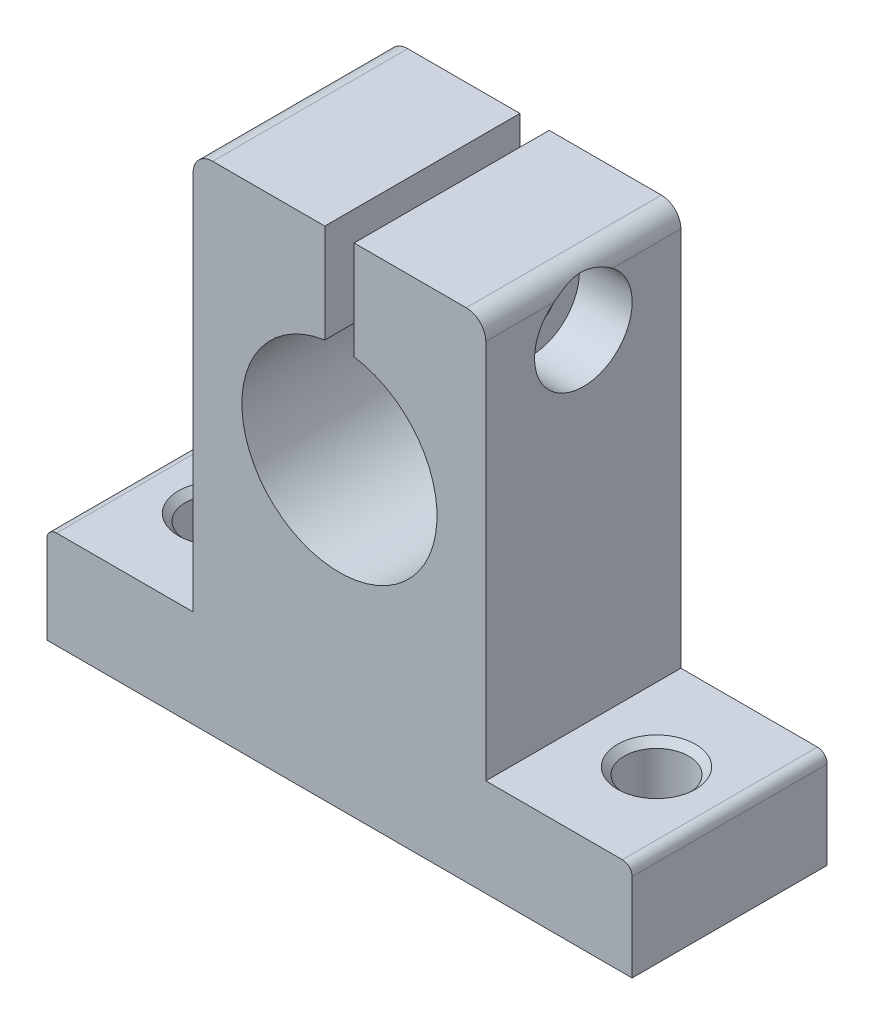
ISO-10303-21;
HEADER;
FILE_DESCRIPTION(('STEP AP214'),'2;1');
FILE_NAME('part.step','',(''),(''),'','','');
FILE_SCHEMA(('AUTOMOTIVE_DESIGN { 1 0 10303 214 1 1 1 1 }'));
ENDSEC;
DATA;
#1=APPLICATION_CONTEXT('core data for automotive mechanical design processes');
#2=APPLICATION_PROTOCOL_DEFINITION('international standard','automotive_design',2000,#1);
#3=PRODUCT_CONTEXT('',#1,'mechanical');
#4=PRODUCT('Part','Part','',(#3));
#5=PRODUCT_RELATED_PRODUCT_CATEGORY('part','',(#4));
#6=PRODUCT_DEFINITION_FORMATION('','',#4);
#7=PRODUCT_DEFINITION_CONTEXT('part definition',#1,'design');
#8=PRODUCT_DEFINITION('design','',#6,#7);
#9=PRODUCT_DEFINITION_SHAPE('','',#8);
#10=(LENGTH_UNIT() NAMED_UNIT(*) SI_UNIT(.MILLI.,.METRE.));
#11=(NAMED_UNIT(*) PLANE_ANGLE_UNIT() SI_UNIT($,.RADIAN.));
#12=(NAMED_UNIT(*) SI_UNIT($,.STERADIAN.) SOLID_ANGLE_UNIT());
#13=UNCERTAINTY_MEASURE_WITH_UNIT(LENGTH_MEASURE(1.E-05),#10,'distance_accuracy_value','');
#14=(GEOMETRIC_REPRESENTATION_CONTEXT(3) GLOBAL_UNCERTAINTY_ASSIGNED_CONTEXT((#13)) GLOBAL_UNIT_ASSIGNED_CONTEXT((#10,
#11,#12)) REPRESENTATION_CONTEXT('',''));
#15=CARTESIAN_POINT('',(0.,0.,0.));
#16=DIRECTION('',(0.,0.,1.));
#17=DIRECTION('',(1.,0.,0.));
#18=AXIS2_PLACEMENT_3D('',#15,#16,#17);
#19=CARTESIAN_POINT('',(-30.,0.,20.));
#20=DIRECTION('',(1.,0.,0.));
#21=DIRECTION('',(0.,0.,-1.));
#22=AXIS2_PLACEMENT_3D('',#19,#20,#21);
#23=PLANE('',#22);
#24=DIRECTION('',(0.,-1.,0.));
#25=VECTOR('',#24,1.);
#26=CARTESIAN_POINT('',(-30.,0.,0.));
#27=LINE('',#26,#25);
#28=CARTESIAN_POINT('',(-30.,8.99999999999999,0.));
#29=VERTEX_POINT('',#28);
#30=CARTESIAN_POINT('',(-30.,0.,0.));
#31=VERTEX_POINT('',#30);
#32=EDGE_CURVE('E198',#29,#31,#27,.T.);
#33=ORIENTED_EDGE('',*,*,#32,.T.);
#34=DIRECTION('',(0.,0.,-1.));
#35=VECTOR('',#34,1.);
#36=CARTESIAN_POINT('',(-30.,0.,20.));
#37=LINE('',#36,#35);
#38=CARTESIAN_POINT('',(-30.,0.,20.));
#39=VERTEX_POINT('',#38);
#40=EDGE_CURVE('E48',#39,#31,#37,.T.);
#41=ORIENTED_EDGE('',*,*,#40,.F.);
#42=DIRECTION('',(0.,-1.,0.));
#43=VECTOR('',#42,1.);
#44=CARTESIAN_POINT('',(-30.,0.,20.));
#45=LINE('',#44,#43);
#46=CARTESIAN_POINT('',(-30.,8.99999999999999,20.));
#47=VERTEX_POINT('',#46);
#48=EDGE_CURVE('E247',#47,#39,#45,.T.);
#49=ORIENTED_EDGE('',*,*,#48,.F.);
#50=DIRECTION('',(0.,0.,-1.));
#51=VECTOR('',#50,1.);
#52=CARTESIAN_POINT('',(-30.,8.99999999999999,20.));
#53=LINE('',#52,#51);
#54=EDGE_CURVE('E194',#47,#29,#53,.T.);
#55=ORIENTED_EDGE('',*,*,#54,.T.);
#56=EDGE_LOOP('',(#33,#41,#49,#55));
#57=FACE_BOUND('',#56,.T.);
#58=ADVANCED_FACE('F39',(#57),#23,.F.);
#59=CARTESIAN_POINT('',(30.,0.,20.));
#60=DIRECTION('',(0.,1.,0.));
#61=DIRECTION('',(0.,0.,1.));
#62=AXIS2_PLACEMENT_3D('',#59,#60,#61);
#63=PLANE('',#62);
#64=CARTESIAN_POINT('',(-22.5,0.,10.));
#65=DIRECTION('',(0.,1.,0.));
#66=DIRECTION('',(0.,0.,1.));
#67=AXIS2_PLACEMENT_3D('',#64,#65,#66);
#68=CIRCLE('',#67,3.3);
#69=CARTESIAN_POINT('',(-22.5,0.,13.3));
#70=VERTEX_POINT('',#69);
#71=EDGE_CURVE('E452',#70,#70,#68,.T.);
#72=ORIENTED_EDGE('',*,*,#71,.T.);
#73=EDGE_LOOP('',(#72));
#74=FACE_BOUND('',#73,.T.);
#75=CARTESIAN_POINT('',(22.5,0.,10.));
#76=DIRECTION('',(0.,1.,0.));
#77=DIRECTION('',(0.,0.,1.));
#78=AXIS2_PLACEMENT_3D('',#75,#76,#77);
#79=CIRCLE('',#78,3.3);
#80=CARTESIAN_POINT('',(22.5,0.,13.3));
#81=VERTEX_POINT('',#80);
#82=EDGE_CURVE('E203',#81,#81,#79,.T.);
#83=ORIENTED_EDGE('',*,*,#82,.T.);
#84=EDGE_LOOP('',(#83));
#85=FACE_BOUND('',#84,.T.);
#86=DIRECTION('',(1.,0.,0.));
#87=VECTOR('',#86,1.);
#88=CARTESIAN_POINT('',(30.,0.,0.));
#89=LINE('',#88,#87);
#90=CARTESIAN_POINT('',(30.,0.,0.));
#91=VERTEX_POINT('',#90);
#92=EDGE_CURVE('E202',#31,#91,#89,.T.);
#93=ORIENTED_EDGE('',*,*,#92,.T.);
#94=DIRECTION('',(0.,0.,-1.));
#95=VECTOR('',#94,1.);
#96=CARTESIAN_POINT('',(30.,0.,20.));
#97=LINE('',#96,#95);
#98=CARTESIAN_POINT('',(30.,0.,20.));
#99=VERTEX_POINT('',#98);
#100=EDGE_CURVE('E295',#99,#91,#97,.T.);
#101=ORIENTED_EDGE('',*,*,#100,.F.);
#102=DIRECTION('',(1.,0.,0.));
#103=VECTOR('',#102,1.);
#104=CARTESIAN_POINT('',(30.,0.,20.));
#105=LINE('',#104,#103);
#106=EDGE_CURVE('E128',#39,#99,#105,.T.);
#107=ORIENTED_EDGE('',*,*,#106,.F.);
#108=ORIENTED_EDGE('',*,*,#40,.T.);
#109=EDGE_LOOP('',(#93,#101,#107,#108));
#110=FACE_BOUND('',#109,.T.);
#111=ADVANCED_FACE('F383',(#74,#85,#110),#63,.F.);
#112=CARTESIAN_POINT('',(30.,0.,20.));
#113=DIRECTION('',(-1.,0.,0.));
#114=DIRECTION('',(0.,0.,1.));
#115=AXIS2_PLACEMENT_3D('',#112,#113,#114);
#116=PLANE('',#115);
#117=DIRECTION('',(0.,1.,0.));
#118=VECTOR('',#117,1.);
#119=CARTESIAN_POINT('',(30.,0.,0.));
#120=LINE('',#119,#118);
#121=CARTESIAN_POINT('',(30.,8.99999999999999,0.));
#122=VERTEX_POINT('',#121);
#123=EDGE_CURVE('E206',#91,#122,#120,.T.);
#124=ORIENTED_EDGE('',*,*,#123,.T.);
#125=DIRECTION('',(0.,0.,-1.));
#126=VECTOR('',#125,1.);
#127=CARTESIAN_POINT('',(30.,8.99999999999999,20.));
#128=LINE('',#127,#126);
#129=CARTESIAN_POINT('',(30.,8.99999999999999,20.));
#130=VERTEX_POINT('',#129);
#131=EDGE_CURVE('E291',#130,#122,#128,.T.);
#132=ORIENTED_EDGE('',*,*,#131,.F.);
#133=DIRECTION('',(0.,1.,0.));
#134=VECTOR('',#133,1.);
#135=CARTESIAN_POINT('',(30.,0.,20.));
#136=LINE('',#135,#134);
#137=EDGE_CURVE('E398',#99,#130,#136,.T.);
#138=ORIENTED_EDGE('',*,*,#137,.F.);
#139=ORIENTED_EDGE('',*,*,#100,.T.);
#140=EDGE_LOOP('',(#124,#132,#138,#139));
#141=FACE_BOUND('',#140,.T.);
#142=ADVANCED_FACE('F388',(#141),#116,.F.);
#143=CARTESIAN_POINT('',(29.,8.99999999999999,20.));
#144=DIRECTION('',(0.,0.,-1.));
#145=DIRECTION('',(-1.,0.,0.));
#146=AXIS2_PLACEMENT_3D('',#143,#144,#145);
#147=CYLINDRICAL_SURFACE('',#146,1.);
#148=CARTESIAN_POINT('',(29.,8.99999999999999,0.));
#149=DIRECTION('',(0.,0.,1.));
#150=DIRECTION('',(1.,0.,0.));
#151=AXIS2_PLACEMENT_3D('',#148,#149,#150);
#152=CIRCLE('',#151,1.);
#153=CARTESIAN_POINT('',(29.,9.99999999999999,0.));
#154=VERTEX_POINT('',#153);
#155=EDGE_CURVE('E209',#122,#154,#152,.T.);
#156=ORIENTED_EDGE('',*,*,#155,.T.);
#157=DIRECTION('',(0.,0.,-1.));
#158=VECTOR('',#157,1.);
#159=CARTESIAN_POINT('',(29.,9.99999999999999,20.));
#160=LINE('',#159,#158);
#161=CARTESIAN_POINT('',(29.,9.99999999999999,20.));
#162=VERTEX_POINT('',#161);
#163=EDGE_CURVE('E287',#162,#154,#160,.T.);
#164=ORIENTED_EDGE('',*,*,#163,.F.);
#165=CARTESIAN_POINT('',(29.,8.99999999999999,20.));
#166=DIRECTION('',(0.,0.,1.));
#167=DIRECTION('',(1.,0.,0.));
#168=AXIS2_PLACEMENT_3D('',#165,#166,#167);
#169=CIRCLE('',#168,1.);
#170=EDGE_CURVE('E401',#130,#162,#169,.T.);
#171=ORIENTED_EDGE('',*,*,#170,.F.);
#172=ORIENTED_EDGE('',*,*,#131,.T.);
#173=EDGE_LOOP('',(#156,#164,#171,#172));
#174=FACE_BOUND('',#173,.T.);
#175=ADVANCED_FACE('F514',(#174),#147,.T.);
#176=CARTESIAN_POINT('',(29.,9.99999999999999,20.));
#177=DIRECTION('',(0.,-1.,0.));
#178=DIRECTION('',(1.,0.,0.));
#179=AXIS2_PLACEMENT_3D('',#176,#177,#178);
#180=PLANE('',#179);
#181=CARTESIAN_POINT('',(22.5,10.,10.));
#182=DIRECTION('',(0.,1.,0.));
#183=DIRECTION('',(0.,0.,1.));
#184=AXIS2_PLACEMENT_3D('',#181,#182,#183);
#185=CIRCLE('',#184,4.);
#186=CARTESIAN_POINT('',(22.5,10.,14.));
#187=VERTEX_POINT('',#186);
#188=EDGE_CURVE('E448',#187,#187,#185,.T.);
#189=ORIENTED_EDGE('',*,*,#188,.F.);
#190=EDGE_LOOP('',(#189));
#191=FACE_BOUND('',#190,.T.);
#192=DIRECTION('',(-1.,0.,0.));
#193=VECTOR('',#192,1.);
#194=CARTESIAN_POINT('',(29.,9.99999999999999,0.));
#195=LINE('',#194,#193);
#196=CARTESIAN_POINT('',(15.,9.99999999999999,0.));
#197=VERTEX_POINT('',#196);
#198=EDGE_CURVE('E212',#154,#197,#195,.T.);
#199=ORIENTED_EDGE('',*,*,#198,.T.);
#200=DIRECTION('',(0.,0.,-1.));
#201=VECTOR('',#200,1.);
#202=CARTESIAN_POINT('',(15.,9.99999999999999,20.));
#203=LINE('',#202,#201);
#204=CARTESIAN_POINT('',(15.,9.99999999999999,20.));
#205=VERTEX_POINT('',#204);
#206=EDGE_CURVE('E283',#205,#197,#203,.T.);
#207=ORIENTED_EDGE('',*,*,#206,.F.);
#208=DIRECTION('',(-1.,0.,0.));
#209=VECTOR('',#208,1.);
#210=CARTESIAN_POINT('',(29.,9.99999999999999,20.));
#211=LINE('',#210,#209);
#212=EDGE_CURVE('E405',#162,#205,#211,.T.);
#213=ORIENTED_EDGE('',*,*,#212,.F.);
#214=ORIENTED_EDGE('',*,*,#163,.T.);
#215=EDGE_LOOP('',(#199,#207,#213,#214));
#216=FACE_BOUND('',#215,.T.);
#217=ADVANCED_FACE('F511',(#191,#216),#180,.F.);
#218=CARTESIAN_POINT('',(15.,9.99999999999999,20.));
#219=DIRECTION('',(-1.,0.,0.));
#220=DIRECTION('',(0.,0.,1.));
#221=AXIS2_PLACEMENT_3D('',#218,#219,#220);
#222=PLANE('',#221);
#223=DIRECTION('',(0.,0.,-1.));
#224=VECTOR('',#223,1.);
#225=CARTESIAN_POINT('',(15.,49.,20.));
#226=LINE('',#225,#224);
#227=CARTESIAN_POINT('',(15.,49.,7.));
#228=VERTEX_POINT('',#227);
#229=CARTESIAN_POINT('',(15.,49.,0.));
#230=VERTEX_POINT('',#229);
#231=EDGE_CURVE('E278',#228,#230,#226,.T.);
#232=ORIENTED_EDGE('',*,*,#231,.F.);
#233=CARTESIAN_POINT('',(15.,45.,10.));
#234=DIRECTION('',(1.,0.,0.));
#235=DIRECTION('',(0.,0.,-1.));
#236=AXIS2_PLACEMENT_3D('',#233,#234,#235);
#237=CIRCLE('',#236,5.);
#238=CARTESIAN_POINT('',(15.,49.,13.));
#239=VERTEX_POINT('',#238);
#240=EDGE_CURVE('E54',#239,#228,#237,.T.);
#241=ORIENTED_EDGE('',*,*,#240,.F.);
#242=CARTESIAN_POINT('',(15.,49.,20.));
#243=VERTEX_POINT('',#242);
#244=EDGE_CURVE('E279',#243,#239,#226,.T.);
#245=ORIENTED_EDGE('',*,*,#244,.F.);
#246=DIRECTION('',(0.,1.,0.));
#247=VECTOR('',#246,1.);
#248=CARTESIAN_POINT('',(15.,9.99999999999999,20.));
#249=LINE('',#248,#247);
#250=EDGE_CURVE('E412',#205,#243,#249,.T.);
#251=ORIENTED_EDGE('',*,*,#250,.F.);
#252=ORIENTED_EDGE('',*,*,#206,.T.);
#253=DIRECTION('',(0.,1.,0.));
#254=VECTOR('',#253,1.);
#255=CARTESIAN_POINT('',(15.,9.99999999999999,0.));
#256=LINE('',#255,#254);
#257=EDGE_CURVE('E215',#197,#230,#256,.T.);
#258=ORIENTED_EDGE('',*,*,#257,.T.);
#259=EDGE_LOOP('',(#232,#241,#245,#251,#252,#258));
#260=FACE_BOUND('',#259,.T.);
#261=ADVANCED_FACE('F380',(#260),#222,.F.);
#262=CARTESIAN_POINT('',(13.,49.,20.));
#263=DIRECTION('',(0.,0.,-1.));
#264=DIRECTION('',(-1.,0.,0.));
#265=AXIS2_PLACEMENT_3D('',#262,#263,#264);
#266=CYLINDRICAL_SURFACE('',#265,2.);
#267=ORIENTED_EDGE('',*,*,#244,.T.);
#268=CARTESIAN_POINT('',(15.,49.,13.));
#269=CARTESIAN_POINT('',(14.9999627426285,49.073365349639,12.9022017719039));
#270=CARTESIAN_POINT('',(14.9959673344251,49.1430492703453,12.8017958483908));
#271=CARTESIAN_POINT('',(14.9821645511714,49.2746427351563,12.5965799668643));
#272=CARTESIAN_POINT('',(14.9723656189678,49.3365634148214,12.4917766115244));
#273=CARTESIAN_POINT('',(14.9490142916285,49.4526004311893,12.2779821991841));
#274=CARTESIAN_POINT('',(14.9354511713035,49.5066937855326,12.1689799542845));
#275=CARTESIAN_POINT('',(14.9064582786575,49.6067386468827,11.9474929656162));
#276=CARTESIAN_POINT('',(14.8910277113784,49.652686665822,11.8350067540177));
#277=CARTESIAN_POINT('',(14.8592988645512,49.7383761111003,11.6012669915831));
#278=CARTESIAN_POINT('',(14.8429959553994,49.7776894794271,11.479856953049));
#279=CARTESIAN_POINT('',(14.8122042222027,49.8469679197311,11.2341750934492));
#280=CARTESIAN_POINT('',(14.797715255665,49.8769337262755,11.1099034980801));
#281=CARTESIAN_POINT('',(14.7722944499944,49.9272366337622,10.859422200353));
#282=CARTESIAN_POINT('',(14.7613526502993,49.9476007709835,10.7332189856673));
#283=CARTESIAN_POINT('',(14.7443117102852,49.9786176485464,10.4792940609346));
#284=CARTESIAN_POINT('',(14.7382123370919,49.9892708558937,10.3515724242089));
#285=CARTESIAN_POINT('',(14.7314868634245,50.0010024925352,10.0894212014314));
#286=CARTESIAN_POINT('',(14.7311358173558,50.0015997883266,9.9549623417556));
#287=CARTESIAN_POINT('',(14.7366687583993,49.9919727395483,9.68655735081131));
#288=CARTESIAN_POINT('',(14.7425533300654,49.981747380416,9.55261126879427));
#289=CARTESIAN_POINT('',(14.7597523900872,49.950571076601,9.28590249108152));
#290=CARTESIAN_POINT('',(14.7710843753365,49.9295855560982,9.1531450226399));
#291=CARTESIAN_POINT('',(14.7976485578075,49.8771090098188,8.89013790764372));
#292=CARTESIAN_POINT('',(14.8128807695244,49.8456179449983,8.75988827041143));
#293=CARTESIAN_POINT('',(14.8444722836205,49.7741884834871,8.50892744517453));
#294=CARTESIAN_POINT('',(14.8607386946885,49.7347444143606,8.38806296562517));
#295=CARTESIAN_POINT('',(14.8931207834144,49.6467544166638,8.1496430429155));
#296=CARTESIAN_POINT('',(14.90923643352,49.5982068572363,8.03208819701071));
#297=CARTESIAN_POINT('',(14.939221140803,49.4923775431855,7.80122541301933));
#298=CARTESIAN_POINT('',(14.9530985184303,49.4351297485658,7.68790300875112));
#299=CARTESIAN_POINT('',(14.9765100584257,49.3119823167169,7.46565184529536));
#300=CARTESIAN_POINT('',(14.9860477715619,49.2460898097852,7.35671956081915));
#301=CARTESIAN_POINT('',(14.994712943948,49.1480237939902,7.20777859726855));
#302=CARTESIAN_POINT('',(14.9966532603159,49.1193278270893,7.16561453515925));
#303=CARTESIAN_POINT('',(14.9992964900782,49.0606321464057,7.08214635020166));
#304=CARTESIAN_POINT('',(14.9999990363677,49.0306320485387,7.0408424860638));
#305=CARTESIAN_POINT('',(15.,49.,7.));
#306=B_SPLINE_CURVE_WITH_KNOTS('',3,(#268,#269,#270,#271,#272,#273,#274,#275,#276,#277,#278,
#279,#280,#281,#282,#283,#284,#285,#286,#287,#288,#289,#290,#291,#292,#293,#294,#295,#296,#297,
#298,#299,#300,#301,#302,#303,#304,#305),.UNSPECIFIED.,.F.,.F.,(4,2,2,2,2,2,2,2,2,2,2,2,2,2,2,2,
2,2,4),(0.,0.366454663596066,0.732377521503599,1.099353890058,1.46648703084372,1.85207387269421,
2.23763040601263,2.62209471236143,3.00654052856014,3.40933085145994,3.81215893701561,
4.21628962578592,4.62042181652453,5.00458358962915,5.38881424978036,5.77158191967416,
6.15403583854523,6.30712169367265,6.46025294424135),.UNSPECIFIED.);
#307=EDGE_CURVE('E11',#239,#228,#306,.T.);
#308=ORIENTED_EDGE('',*,*,#307,.T.);
#309=ORIENTED_EDGE('',*,*,#231,.T.);
#310=CARTESIAN_POINT('',(13.,49.,0.));
#311=DIRECTION('',(0.,0.,1.));
#312=DIRECTION('',(1.,0.,0.));
#313=AXIS2_PLACEMENT_3D('',#310,#311,#312);
#314=CIRCLE('',#313,2.);
#315=CARTESIAN_POINT('',(13.,51.,0.));
#316=VERTEX_POINT('',#315);
#317=EDGE_CURVE('E219',#230,#316,#314,.T.);
#318=ORIENTED_EDGE('',*,*,#317,.T.);
#319=DIRECTION('',(0.,0.,-1.));
#320=VECTOR('',#319,1.);
#321=CARTESIAN_POINT('',(13.,51.,20.));
#322=LINE('',#321,#320);
#323=CARTESIAN_POINT('',(13.,51.,20.));
#324=VERTEX_POINT('',#323);
#325=EDGE_CURVE('E274',#324,#316,#322,.T.);
#326=ORIENTED_EDGE('',*,*,#325,.F.);
#327=CARTESIAN_POINT('',(13.,49.,20.));
#328=DIRECTION('',(0.,0.,1.));
#329=DIRECTION('',(1.,0.,0.));
#330=AXIS2_PLACEMENT_3D('',#327,#328,#329);
#331=CIRCLE('',#330,2.);
#332=EDGE_CURVE('E415',#243,#324,#331,.T.);
#333=ORIENTED_EDGE('',*,*,#332,.F.);
#334=EDGE_LOOP('',(#267,#308,#309,#318,#326,#333));
#335=FACE_BOUND('',#334,.T.);
#336=ADVANCED_FACE('F306',(#335),#266,.T.);
#337=CARTESIAN_POINT('',(13.,51.,20.));
#338=DIRECTION('',(0.,-1.,0.));
#339=DIRECTION('',(1.,0.,0.));
#340=AXIS2_PLACEMENT_3D('',#337,#338,#339);
#341=PLANE('',#340);
#342=DIRECTION('',(-1.,0.,0.));
#343=VECTOR('',#342,1.);
#344=CARTESIAN_POINT('',(13.,51.,0.));
#345=LINE('',#344,#343);
#346=CARTESIAN_POINT('',(1.5,51.,0.));
#347=VERTEX_POINT('',#346);
#348=EDGE_CURVE('E222',#316,#347,#345,.T.);
#349=ORIENTED_EDGE('',*,*,#348,.T.);
#350=DIRECTION('',(0.,0.,-1.));
#351=VECTOR('',#350,1.);
#352=CARTESIAN_POINT('',(1.5,51.,20.));
#353=LINE('',#352,#351);
#354=CARTESIAN_POINT('',(1.5,51.,20.));
#355=VERTEX_POINT('',#354);
#356=EDGE_CURVE('E270',#355,#347,#353,.T.);
#357=ORIENTED_EDGE('',*,*,#356,.F.);
#358=DIRECTION('',(-1.,0.,0.));
#359=VECTOR('',#358,1.);
#360=CARTESIAN_POINT('',(13.,51.,20.));
#361=LINE('',#360,#359);
#362=EDGE_CURVE('E418',#324,#355,#361,.T.);
#363=ORIENTED_EDGE('',*,*,#362,.F.);
#364=ORIENTED_EDGE('',*,*,#325,.T.);
#365=EDGE_LOOP('',(#349,#357,#363,#364));
#366=FACE_BOUND('',#365,.T.);
#367=ADVANCED_FACE('F373',(#366),#341,.F.);
#368=CARTESIAN_POINT('',(1.5,51.,20.));
#369=DIRECTION('',(1.,0.,0.));
#370=DIRECTION('',(0.,1.,0.));
#371=AXIS2_PLACEMENT_3D('',#368,#369,#370);
#372=PLANE('',#371);
#373=CARTESIAN_POINT('',(1.5,45.,10.));
#374=DIRECTION('',(1.,0.,0.));
#375=DIRECTION('',(0.,1.,0.));
#376=AXIS2_PLACEMENT_3D('',#373,#374,#375);
#377=CIRCLE('',#376,2.74999999999999);
#378=CARTESIAN_POINT('',(1.5,47.75,10.));
#379=VERTEX_POINT('',#378);
#380=EDGE_CURVE('E468',#379,#379,#377,.T.);
#381=ORIENTED_EDGE('',*,*,#380,.T.);
#382=EDGE_LOOP('',(#381));
#383=FACE_BOUND('',#382,.T.);
#384=DIRECTION('',(0.,-1.,0.));
#385=VECTOR('',#384,1.);
#386=CARTESIAN_POINT('',(1.5,51.,0.));
#387=LINE('',#386,#385);
#388=CARTESIAN_POINT('',(1.5,40.8868599666426,0.));
#389=VERTEX_POINT('',#388);
#390=EDGE_CURVE('E225',#347,#389,#387,.T.);
#391=ORIENTED_EDGE('',*,*,#390,.T.);
#392=DIRECTION('',(0.,0.,-1.));
#393=VECTOR('',#392,1.);
#394=CARTESIAN_POINT('',(1.5,40.8868599666426,20.));
#395=LINE('',#394,#393);
#396=CARTESIAN_POINT('',(1.5,40.8868599666426,20.));
#397=VERTEX_POINT('',#396);
#398=EDGE_CURVE('E266',#397,#389,#395,.T.);
#399=ORIENTED_EDGE('',*,*,#398,.F.);
#400=DIRECTION('',(0.,-1.,0.));
#401=VECTOR('',#400,1.);
#402=CARTESIAN_POINT('',(1.5,51.,20.));
#403=LINE('',#402,#401);
#404=EDGE_CURVE('E421',#355,#397,#403,.T.);
#405=ORIENTED_EDGE('',*,*,#404,.F.);
#406=ORIENTED_EDGE('',*,*,#356,.T.);
#407=EDGE_LOOP('',(#391,#399,#405,#406));
#408=FACE_BOUND('',#407,.T.);
#409=ADVANCED_FACE('F370',(#383,#408),#372,.F.);
#410=CARTESIAN_POINT('',(0.,31.,20.));
#411=DIRECTION('',(0.,0.,-1.));
#412=DIRECTION('',(-1.,0.,0.));
#413=AXIS2_PLACEMENT_3D('',#410,#411,#412);
#414=CYLINDRICAL_SURFACE('',#413,10.);
#415=CARTESIAN_POINT('',(0.,31.,0.));
#416=DIRECTION('',(0.,0.,-1.));
#417=DIRECTION('',(1.,0.,0.));
#418=AXIS2_PLACEMENT_3D('',#415,#416,#417);
#419=CIRCLE('',#418,10.);
#420=CARTESIAN_POINT('',(-1.5,40.8868599666426,0.));
#421=VERTEX_POINT('',#420);
#422=EDGE_CURVE('E228',#389,#421,#419,.T.);
#423=ORIENTED_EDGE('',*,*,#422,.T.);
#424=DIRECTION('',(0.,0.,-1.));
#425=VECTOR('',#424,1.);
#426=CARTESIAN_POINT('',(-1.5,40.8868599666426,20.));
#427=LINE('',#426,#425);
#428=CARTESIAN_POINT('',(-1.5,40.8868599666426,20.));
#429=VERTEX_POINT('',#428);
#430=EDGE_CURVE('E262',#429,#421,#427,.T.);
#431=ORIENTED_EDGE('',*,*,#430,.F.);
#432=CARTESIAN_POINT('',(0.,31.,20.));
#433=DIRECTION('',(0.,0.,-1.));
#434=DIRECTION('',(1.,0.,0.));
#435=AXIS2_PLACEMENT_3D('',#432,#433,#434);
#436=CIRCLE('',#435,10.);
#437=EDGE_CURVE('E424',#397,#429,#436,.T.);
#438=ORIENTED_EDGE('',*,*,#437,.F.);
#439=ORIENTED_EDGE('',*,*,#398,.T.);
#440=EDGE_LOOP('',(#423,#431,#438,#439));
#441=FACE_BOUND('',#440,.T.);
#442=ADVANCED_FACE('F366',(#441),#414,.F.);
#443=CARTESIAN_POINT('',(-1.5,51.,20.));
#444=DIRECTION('',(-1.,0.,0.));
#445=DIRECTION('',(0.,-1.,0.));
#446=AXIS2_PLACEMENT_3D('',#443,#444,#445);
#447=PLANE('',#446);
#448=CARTESIAN_POINT('',(-1.5,45.,10.));
#449=DIRECTION('',(-1.,0.,0.));
#450=DIRECTION('',(0.,-1.,0.));
#451=AXIS2_PLACEMENT_3D('',#448,#449,#450);
#452=CIRCLE('',#451,2.74999999999999);
#453=CARTESIAN_POINT('',(-1.5,42.25,10.));
#454=VERTEX_POINT('',#453);
#455=EDGE_CURVE('E464',#454,#454,#452,.T.);
#456=ORIENTED_EDGE('',*,*,#455,.T.);
#457=EDGE_LOOP('',(#456));
#458=FACE_BOUND('',#457,.T.);
#459=DIRECTION('',(0.,1.,0.));
#460=VECTOR('',#459,1.);
#461=CARTESIAN_POINT('',(-1.5,51.,0.));
#462=LINE('',#461,#460);
#463=CARTESIAN_POINT('',(-1.5,51.,0.));
#464=VERTEX_POINT('',#463);
#465=EDGE_CURVE('E231',#421,#464,#462,.T.);
#466=ORIENTED_EDGE('',*,*,#465,.T.);
#467=DIRECTION('',(0.,0.,-1.));
#468=VECTOR('',#467,1.);
#469=CARTESIAN_POINT('',(-1.5,51.,20.));
#470=LINE('',#469,#468);
#471=CARTESIAN_POINT('',(-1.5,51.,20.));
#472=VERTEX_POINT('',#471);
#473=EDGE_CURVE('E258',#472,#464,#470,.T.);
#474=ORIENTED_EDGE('',*,*,#473,.F.);
#475=DIRECTION('',(0.,1.,0.));
#476=VECTOR('',#475,1.);
#477=CARTESIAN_POINT('',(-1.5,51.,20.));
#478=LINE('',#477,#476);
#479=EDGE_CURVE('E427',#429,#472,#478,.T.);
#480=ORIENTED_EDGE('',*,*,#479,.F.);
#481=ORIENTED_EDGE('',*,*,#430,.T.);
#482=EDGE_LOOP('',(#466,#474,#480,#481));
#483=FACE_BOUND('',#482,.T.);
#484=ADVANCED_FACE('F362',(#458,#483),#447,.F.);
#485=CARTESIAN_POINT('',(-13.,51.,20.));
#486=DIRECTION('',(0.,-1.,0.));
#487=DIRECTION('',(1.,0.,0.));
#488=AXIS2_PLACEMENT_3D('',#485,#486,#487);
#489=PLANE('',#488);
#490=DIRECTION('',(-1.,0.,0.));
#491=VECTOR('',#490,1.);
#492=CARTESIAN_POINT('',(-13.,51.,0.));
#493=LINE('',#492,#491);
#494=CARTESIAN_POINT('',(-13.,51.,0.));
#495=VERTEX_POINT('',#494);
#496=EDGE_CURVE('E234',#464,#495,#493,.T.);
#497=ORIENTED_EDGE('',*,*,#496,.T.);
#498=DIRECTION('',(0.,0.,-1.));
#499=VECTOR('',#498,1.);
#500=CARTESIAN_POINT('',(-13.,51.,20.));
#501=LINE('',#500,#499);
#502=CARTESIAN_POINT('',(-13.,51.,20.));
#503=VERTEX_POINT('',#502);
#504=EDGE_CURVE('E254',#503,#495,#501,.T.);
#505=ORIENTED_EDGE('',*,*,#504,.F.);
#506=DIRECTION('',(-1.,0.,0.));
#507=VECTOR('',#506,1.);
#508=CARTESIAN_POINT('',(-13.,51.,20.));
#509=LINE('',#508,#507);
#510=EDGE_CURVE('E430',#472,#503,#509,.T.);
#511=ORIENTED_EDGE('',*,*,#510,.F.);
#512=ORIENTED_EDGE('',*,*,#473,.T.);
#513=EDGE_LOOP('',(#497,#505,#511,#512));
#514=FACE_BOUND('',#513,.T.);
#515=ADVANCED_FACE('F358',(#514),#489,.F.);
#516=CARTESIAN_POINT('',(-13.,49.,20.));
#517=DIRECTION('',(0.,0.,-1.));
#518=DIRECTION('',(-1.,0.,0.));
#519=AXIS2_PLACEMENT_3D('',#516,#517,#518);
#520=CYLINDRICAL_SURFACE('',#519,2.);
#521=CARTESIAN_POINT('',(-13.,49.,0.));
#522=DIRECTION('',(0.,0.,1.));
#523=DIRECTION('',(-1.,0.,0.));
#524=AXIS2_PLACEMENT_3D('',#521,#522,#523);
#525=CIRCLE('',#524,2.);
#526=CARTESIAN_POINT('',(-15.,49.,0.));
#527=VERTEX_POINT('',#526);
#528=EDGE_CURVE('E237',#495,#527,#525,.T.);
#529=ORIENTED_EDGE('',*,*,#528,.T.);
#530=DIRECTION('',(0.,0.,-1.));
#531=VECTOR('',#530,1.);
#532=CARTESIAN_POINT('',(-15.,49.,20.));
#533=LINE('',#532,#531);
#534=CARTESIAN_POINT('',(-15.,49.,20.));
#535=VERTEX_POINT('',#534);
#536=EDGE_CURVE('E187',#535,#527,#533,.T.);
#537=ORIENTED_EDGE('',*,*,#536,.F.);
#538=CARTESIAN_POINT('',(-13.,49.,20.));
#539=DIRECTION('',(0.,0.,1.));
#540=DIRECTION('',(-1.,0.,0.));
#541=AXIS2_PLACEMENT_3D('',#538,#539,#540);
#542=CIRCLE('',#541,2.);
#543=EDGE_CURVE('E173',#503,#535,#542,.T.);
#544=ORIENTED_EDGE('',*,*,#543,.F.);
#545=ORIENTED_EDGE('',*,*,#504,.T.);
#546=EDGE_LOOP('',(#529,#537,#544,#545));
#547=FACE_BOUND('',#546,.T.);
#548=ADVANCED_FACE('F354',(#547),#520,.T.);
#549=CARTESIAN_POINT('',(-15.,9.99999999999999,20.));
#550=DIRECTION('',(1.,0.,0.));
#551=DIRECTION('',(0.,0.,-1.));
#552=AXIS2_PLACEMENT_3D('',#549,#550,#551);
#553=PLANE('',#552);
#554=CARTESIAN_POINT('',(-15.,45.,10.));
#555=DIRECTION('',(1.,0.,0.));
#556=DIRECTION('',(0.,0.,-1.));
#557=AXIS2_PLACEMENT_3D('',#554,#555,#556);
#558=CIRCLE('',#557,2.74999999999999);
#559=CARTESIAN_POINT('',(-15.,45.,7.25000000000001));
#560=VERTEX_POINT('',#559);
#561=EDGE_CURVE('E42',#560,#560,#558,.T.);
#562=ORIENTED_EDGE('',*,*,#561,.T.);
#563=EDGE_LOOP('',(#562));
#564=FACE_BOUND('',#563,.T.);
#565=DIRECTION('',(0.,-1.,0.));
#566=VECTOR('',#565,1.);
#567=CARTESIAN_POINT('',(-15.,9.99999999999999,0.));
#568=LINE('',#567,#566);
#569=CARTESIAN_POINT('',(-15.,9.99999999999999,0.));
#570=VERTEX_POINT('',#569);
#571=EDGE_CURVE('E183',#527,#570,#568,.T.);
#572=ORIENTED_EDGE('',*,*,#571,.T.);
#573=DIRECTION('',(0.,0.,-1.));
#574=VECTOR('',#573,1.);
#575=CARTESIAN_POINT('',(-15.,9.99999999999999,20.));
#576=LINE('',#575,#574);
#577=CARTESIAN_POINT('',(-15.,9.99999999999999,20.));
#578=VERTEX_POINT('',#577);
#579=EDGE_CURVE('E180',#578,#570,#576,.T.);
#580=ORIENTED_EDGE('',*,*,#579,.F.);
#581=DIRECTION('',(0.,-1.,0.));
#582=VECTOR('',#581,1.);
#583=CARTESIAN_POINT('',(-15.,9.99999999999999,20.));
#584=LINE('',#583,#582);
#585=EDGE_CURVE('E166',#535,#578,#584,.T.);
#586=ORIENTED_EDGE('',*,*,#585,.F.);
#587=ORIENTED_EDGE('',*,*,#536,.T.);
#588=EDGE_LOOP('',(#572,#580,#586,#587));
#589=FACE_BOUND('',#588,.T.);
#590=ADVANCED_FACE('F181',(#564,#589),#553,.F.);
#591=CARTESIAN_POINT('',(-29.,9.99999999999999,20.));
#592=DIRECTION('',(0.,-1.,0.));
#593=DIRECTION('',(1.,0.,0.));
#594=AXIS2_PLACEMENT_3D('',#591,#592,#593);
#595=PLANE('',#594);
#596=CARTESIAN_POINT('',(-22.5,9.99999999999999,10.));
#597=DIRECTION('',(0.,1.,0.));
#598=DIRECTION('',(0.,0.,1.));
#599=AXIS2_PLACEMENT_3D('',#596,#597,#598);
#600=CIRCLE('',#599,4.);
#601=CARTESIAN_POINT('',(-22.5,9.99999999999999,14.));
#602=VERTEX_POINT('',#601);
#603=EDGE_CURVE('E460',#602,#602,#600,.T.);
#604=ORIENTED_EDGE('',*,*,#603,.F.);
#605=EDGE_LOOP('',(#604));
#606=FACE_BOUND('',#605,.T.);
#607=DIRECTION('',(-1.,0.,0.));
#608=VECTOR('',#607,1.);
#609=CARTESIAN_POINT('',(-29.,9.99999999999999,0.));
#610=LINE('',#609,#608);
#611=CARTESIAN_POINT('',(-29.,9.99999999999999,0.));
#612=VERTEX_POINT('',#611);
#613=EDGE_CURVE('E242',#570,#612,#610,.T.);
#614=ORIENTED_EDGE('',*,*,#613,.T.);
#615=DIRECTION('',(0.,0.,-1.));
#616=VECTOR('',#615,1.);
#617=CARTESIAN_POINT('',(-29.,9.99999999999999,20.));
#618=LINE('',#617,#616);
#619=CARTESIAN_POINT('',(-29.,9.99999999999999,20.));
#620=VERTEX_POINT('',#619);
#621=EDGE_CURVE('E188',#620,#612,#618,.T.);
#622=ORIENTED_EDGE('',*,*,#621,.F.);
#623=DIRECTION('',(-1.,0.,0.));
#624=VECTOR('',#623,1.);
#625=CARTESIAN_POINT('',(-29.,9.99999999999999,20.));
#626=LINE('',#625,#624);
#627=EDGE_CURVE('E170',#578,#620,#626,.T.);
#628=ORIENTED_EDGE('',*,*,#627,.F.);
#629=ORIENTED_EDGE('',*,*,#579,.T.);
#630=EDGE_LOOP('',(#614,#622,#628,#629));
#631=FACE_BOUND('',#630,.T.);
#632=ADVANCED_FACE('F190',(#606,#631),#595,.F.);
#633=CARTESIAN_POINT('',(-29.,8.99999999999999,20.));
#634=DIRECTION('',(0.,0.,-1.));
#635=DIRECTION('',(-1.,0.,0.));
#636=AXIS2_PLACEMENT_3D('',#633,#634,#635);
#637=CYLINDRICAL_SURFACE('',#636,1.);
#638=CARTESIAN_POINT('',(-29.,8.99999999999999,0.));
#639=DIRECTION('',(0.,0.,1.));
#640=DIRECTION('',(-1.,0.,0.));
#641=AXIS2_PLACEMENT_3D('',#638,#639,#640);
#642=CIRCLE('',#641,1.);
#643=EDGE_CURVE('E119',#612,#29,#642,.T.);
#644=ORIENTED_EDGE('',*,*,#643,.T.);
#645=ORIENTED_EDGE('',*,*,#54,.F.);
#646=CARTESIAN_POINT('',(-29.,8.99999999999999,20.));
#647=DIRECTION('',(0.,0.,1.));
#648=DIRECTION('',(-1.,0.,0.));
#649=AXIS2_PLACEMENT_3D('',#646,#647,#648);
#650=CIRCLE('',#649,1.);
#651=EDGE_CURVE('E62',#620,#47,#650,.T.);
#652=ORIENTED_EDGE('',*,*,#651,.F.);
#653=ORIENTED_EDGE('',*,*,#621,.T.);
#654=EDGE_LOOP('',(#644,#645,#652,#653));
#655=FACE_BOUND('',#654,.T.);
#656=ADVANCED_FACE('F343',(#655),#637,.T.);
#657=CARTESIAN_POINT('',(-29.,8.99999999999999,20.));
#658=DIRECTION('',(0.,0.,-1.));
#659=DIRECTION('',(-1.,0.,0.));
#660=AXIS2_PLACEMENT_3D('',#657,#658,#659);
#661=PLANE('',#660);
#662=ORIENTED_EDGE('',*,*,#48,.T.);
#663=ORIENTED_EDGE('',*,*,#106,.T.);
#664=ORIENTED_EDGE('',*,*,#137,.T.);
#665=ORIENTED_EDGE('',*,*,#170,.T.);
#666=ORIENTED_EDGE('',*,*,#212,.T.);
#667=ORIENTED_EDGE('',*,*,#250,.T.);
#668=ORIENTED_EDGE('',*,*,#332,.T.);
#669=ORIENTED_EDGE('',*,*,#362,.T.);
#670=ORIENTED_EDGE('',*,*,#404,.T.);
#671=ORIENTED_EDGE('',*,*,#437,.T.);
#672=ORIENTED_EDGE('',*,*,#479,.T.);
#673=ORIENTED_EDGE('',*,*,#510,.T.);
#674=ORIENTED_EDGE('',*,*,#543,.T.);
#675=ORIENTED_EDGE('',*,*,#585,.T.);
#676=ORIENTED_EDGE('',*,*,#627,.T.);
#677=ORIENTED_EDGE('',*,*,#651,.T.);
#678=EDGE_LOOP('',(#662,#663,#664,#665,#666,#667,#668,#669,#670,#671,#672,#673,#674,#675,#676,#677));
#679=FACE_BOUND('',#678,.T.);
#680=ADVANCED_FACE('F168',(#679),#661,.F.);
#681=CARTESIAN_POINT('',(-29.,8.99999999999999,0.));
#682=DIRECTION('',(0.,0.,-1.));
#683=DIRECTION('',(-1.,0.,0.));
#684=AXIS2_PLACEMENT_3D('',#681,#682,#683);
#685=PLANE('',#684);
#686=ORIENTED_EDGE('',*,*,#32,.F.);
#687=ORIENTED_EDGE('',*,*,#643,.F.);
#688=ORIENTED_EDGE('',*,*,#613,.F.);
#689=ORIENTED_EDGE('',*,*,#571,.F.);
#690=ORIENTED_EDGE('',*,*,#528,.F.);
#691=ORIENTED_EDGE('',*,*,#496,.F.);
#692=ORIENTED_EDGE('',*,*,#465,.F.);
#693=ORIENTED_EDGE('',*,*,#422,.F.);
#694=ORIENTED_EDGE('',*,*,#390,.F.);
#695=ORIENTED_EDGE('',*,*,#348,.F.);
#696=ORIENTED_EDGE('',*,*,#317,.F.);
#697=ORIENTED_EDGE('',*,*,#257,.F.);
#698=ORIENTED_EDGE('',*,*,#198,.F.);
#699=ORIENTED_EDGE('',*,*,#155,.F.);
#700=ORIENTED_EDGE('',*,*,#123,.F.);
#701=ORIENTED_EDGE('',*,*,#92,.F.);
#702=EDGE_LOOP('',(#686,#687,#688,#689,#690,#691,#692,#693,#694,#695,#696,#697,#698,#699,#700,#701));
#703=FACE_BOUND('',#702,.T.);
#704=ADVANCED_FACE('F339',(#703),#685,.T.);
#705=CARTESIAN_POINT('',(22.5,10.,10.));
#706=DIRECTION('',(0.,1.,0.));
#707=DIRECTION('',(0.,0.,1.));
#708=AXIS2_PLACEMENT_3D('',#705,#706,#707);
#709=CYLINDRICAL_SURFACE('',#708,3.3);
#710=ORIENTED_EDGE('',*,*,#82,.F.);
#711=EDGE_LOOP('',(#710));
#712=FACE_BOUND('',#711,.T.);
#713=CARTESIAN_POINT('',(22.5,9.3,10.));
#714=DIRECTION('',(0.,1.,0.));
#715=DIRECTION('',(0.,0.,1.));
#716=AXIS2_PLACEMENT_3D('',#713,#714,#715);
#717=CIRCLE('',#716,3.3);
#718=CARTESIAN_POINT('',(22.5,9.3,13.3));
#719=VERTEX_POINT('',#718);
#720=EDGE_CURVE('E444',#719,#719,#717,.T.);
#721=ORIENTED_EDGE('',*,*,#720,.T.);
#722=EDGE_LOOP('',(#721));
#723=FACE_BOUND('',#722,.T.);
#724=ADVANCED_FACE('F335',(#712,#723),#709,.F.);
#725=CARTESIAN_POINT('',(22.5,10.,10.));
#726=DIRECTION('',(0.,1.,0.));
#727=DIRECTION('',(0.,0.,1.));
#728=AXIS2_PLACEMENT_3D('',#725,#726,#727);
#729=CONICAL_SURFACE('',#728,4.,0.78539816339745);
#730=ORIENTED_EDGE('',*,*,#720,.F.);
#731=EDGE_LOOP('',(#730));
#732=FACE_BOUND('',#731,.T.);
#733=ORIENTED_EDGE('',*,*,#188,.T.);
#734=EDGE_LOOP('',(#733));
#735=FACE_BOUND('',#734,.T.);
#736=ADVANCED_FACE('F331',(#732,#735),#729,.F.);
#737=CARTESIAN_POINT('',(-22.5,9.99999999999999,10.));
#738=DIRECTION('',(0.,1.,0.));
#739=DIRECTION('',(0.,0.,1.));
#740=AXIS2_PLACEMENT_3D('',#737,#738,#739);
#741=CYLINDRICAL_SURFACE('',#740,3.3);
#742=ORIENTED_EDGE('',*,*,#71,.F.);
#743=EDGE_LOOP('',(#742));
#744=FACE_BOUND('',#743,.T.);
#745=CARTESIAN_POINT('',(-22.5,9.29999999999999,10.));
#746=DIRECTION('',(0.,1.,0.));
#747=DIRECTION('',(0.,0.,1.));
#748=AXIS2_PLACEMENT_3D('',#745,#746,#747);
#749=CIRCLE('',#748,3.3);
#750=CARTESIAN_POINT('',(-22.5,9.29999999999999,13.3));
#751=VERTEX_POINT('',#750);
#752=EDGE_CURVE('E456',#751,#751,#749,.T.);
#753=ORIENTED_EDGE('',*,*,#752,.T.);
#754=EDGE_LOOP('',(#753));
#755=FACE_BOUND('',#754,.T.);
#756=ADVANCED_FACE('F327',(#744,#755),#741,.F.);
#757=CARTESIAN_POINT('',(-22.5,9.99999999999999,10.));
#758=DIRECTION('',(0.,1.,0.));
#759=DIRECTION('',(0.,0.,1.));
#760=AXIS2_PLACEMENT_3D('',#757,#758,#759);
#761=CONICAL_SURFACE('',#760,4.,0.78539816339745);
#762=ORIENTED_EDGE('',*,*,#752,.F.);
#763=EDGE_LOOP('',(#762));
#764=FACE_BOUND('',#763,.T.);
#765=ORIENTED_EDGE('',*,*,#603,.T.);
#766=EDGE_LOOP('',(#765));
#767=FACE_BOUND('',#766,.T.);
#768=ADVANCED_FACE('F324',(#764,#767),#761,.F.);
#769=CARTESIAN_POINT('',(15.,45.,10.));
#770=DIRECTION('',(1.,0.,0.));
#771=DIRECTION('',(0.,0.,-1.));
#772=AXIS2_PLACEMENT_3D('',#769,#770,#771);
#773=CYLINDRICAL_SURFACE('',#772,2.74999999999999);
#774=CARTESIAN_POINT('',(9.6,45.,10.));
#775=DIRECTION('',(1.,0.,0.));
#776=DIRECTION('',(0.,0.,-1.));
#777=AXIS2_PLACEMENT_3D('',#774,#775,#776);
#778=CIRCLE('',#777,2.75);
#779=CARTESIAN_POINT('',(9.6,45.,7.25));
#780=VERTEX_POINT('',#779);
#781=EDGE_CURVE('E472',#780,#780,#778,.T.);
#782=ORIENTED_EDGE('',*,*,#781,.T.);
#783=EDGE_LOOP('',(#782));
#784=FACE_BOUND('',#783,.T.);
#785=ORIENTED_EDGE('',*,*,#380,.F.);
#786=EDGE_LOOP('',(#785));
#787=FACE_BOUND('',#786,.T.);
#788=ADVANCED_FACE('F319',(#784,#787),#773,.F.);
#789=CARTESIAN_POINT('',(9.6,47.75,10.));
#790=DIRECTION('',(-1.,0.,0.));
#791=DIRECTION('',(0.,0.,1.));
#792=AXIS2_PLACEMENT_3D('',#789,#790,#791);
#793=PLANE('',#792);
#794=ORIENTED_EDGE('',*,*,#781,.F.);
#795=EDGE_LOOP('',(#794));
#796=FACE_BOUND('',#795,.T.);
#797=CARTESIAN_POINT('',(9.6,45.,10.));
#798=DIRECTION('',(1.,0.,0.));
#799=DIRECTION('',(0.,0.,-1.));
#800=AXIS2_PLACEMENT_3D('',#797,#798,#799);
#801=CIRCLE('',#800,5.);
#802=CARTESIAN_POINT('',(9.6,45.,5.));
#803=VERTEX_POINT('',#802);
#804=EDGE_CURVE('E476',#803,#803,#801,.T.);
#805=ORIENTED_EDGE('',*,*,#804,.T.);
#806=EDGE_LOOP('',(#805));
#807=FACE_BOUND('',#806,.T.);
#808=ADVANCED_FACE('F315',(#796,#807),#793,.F.);
#809=CARTESIAN_POINT('',(15.,45.,10.));
#810=DIRECTION('',(1.,0.,0.));
#811=DIRECTION('',(0.,0.,-1.));
#812=AXIS2_PLACEMENT_3D('',#809,#810,#811);
#813=CYLINDRICAL_SURFACE('',#812,5.);
#814=ORIENTED_EDGE('',*,*,#804,.F.);
#815=EDGE_LOOP('',(#814));
#816=FACE_BOUND('',#815,.T.);
#817=ORIENTED_EDGE('',*,*,#240,.T.);
#818=ORIENTED_EDGE('',*,*,#307,.F.);
#819=EDGE_LOOP('',(#817,#818));
#820=FACE_BOUND('',#819,.T.);
#821=ADVANCED_FACE('F310',(#816,#820),#813,.F.);
#822=ORIENTED_EDGE('',*,*,#561,.F.);
#823=EDGE_LOOP('',(#822));
#824=FACE_BOUND('',#823,.T.);
#825=ORIENTED_EDGE('',*,*,#455,.F.);
#826=EDGE_LOOP('',(#825));
#827=FACE_BOUND('',#826,.T.);
#828=ADVANCED_FACE('F314',(#824,#827),#773,.F.);
#829=CLOSED_SHELL('',(#58,#111,#142,#175,#217,#261,#336,#367,#409,#442,#484,#515,#548,#590,#632,
#656,#680,#704,#724,#736,#756,#768,#788,#808,#821,#828));
#830=MANIFOLD_SOLID_BREP('B2',#829);
#831=ADVANCED_BREP_SHAPE_REPRESENTATION('',(#18,#830),#14);
#832=SHAPE_DEFINITION_REPRESENTATION(#9,#831);
ENDSEC;
END-ISO-10303-21;
